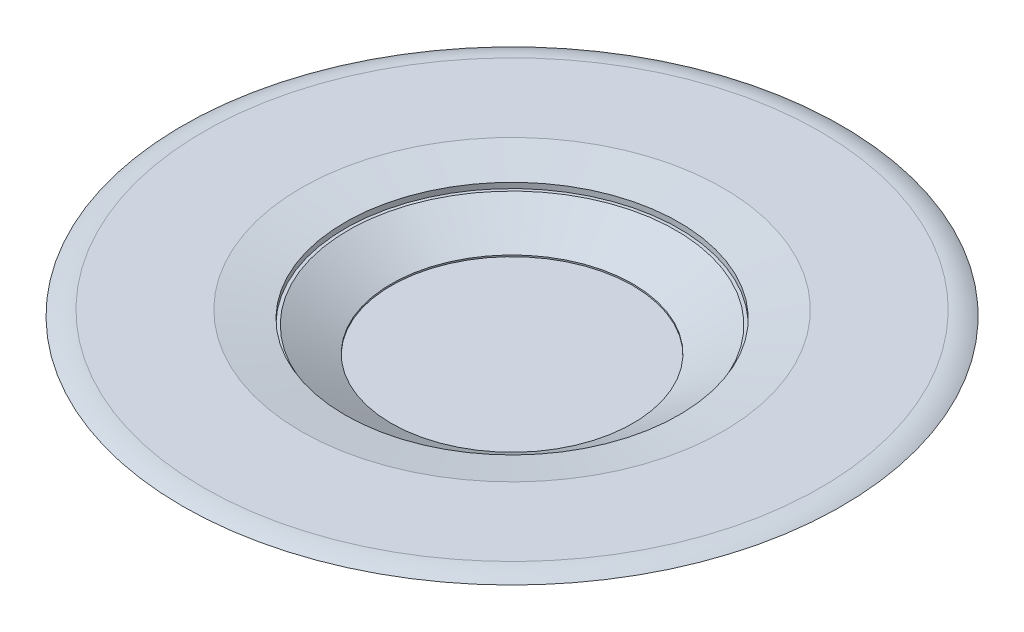
ISO-10303-21;
HEADER;
FILE_DESCRIPTION(('STEP AP214'),'2;1');
FILE_NAME('part.step','',(''),(''),'','','');
FILE_SCHEMA(('AUTOMOTIVE_DESIGN { 1 0 10303 214 1 1 1 1 }'));
ENDSEC;
DATA;
#1=APPLICATION_CONTEXT('core data for automotive mechanical design processes');
#2=APPLICATION_PROTOCOL_DEFINITION('international standard','automotive_design',2000,#1);
#3=PRODUCT_CONTEXT('',#1,'mechanical');
#4=PRODUCT('Part','Part','',(#3));
#5=PRODUCT_RELATED_PRODUCT_CATEGORY('part','',(#4));
#6=PRODUCT_DEFINITION_FORMATION('','',#4);
#7=PRODUCT_DEFINITION_CONTEXT('part definition',#1,'design');
#8=PRODUCT_DEFINITION('design','',#6,#7);
#9=PRODUCT_DEFINITION_SHAPE('','',#8);
#10=(LENGTH_UNIT() NAMED_UNIT(*) SI_UNIT(.MILLI.,.METRE.));
#11=(NAMED_UNIT(*) PLANE_ANGLE_UNIT() SI_UNIT($,.RADIAN.));
#12=(NAMED_UNIT(*) SI_UNIT($,.STERADIAN.) SOLID_ANGLE_UNIT());
#13=UNCERTAINTY_MEASURE_WITH_UNIT(LENGTH_MEASURE(1.E-05),#10,'distance_accuracy_value','');
#14=(GEOMETRIC_REPRESENTATION_CONTEXT(3) GLOBAL_UNCERTAINTY_ASSIGNED_CONTEXT((#13)) GLOBAL_UNIT_ASSIGNED_CONTEXT((#10,
#11,#12)) REPRESENTATION_CONTEXT('',''));
#15=CARTESIAN_POINT('',(0.,0.,0.));
#16=DIRECTION('',(0.,0.,1.));
#17=DIRECTION('',(1.,0.,0.));
#18=AXIS2_PLACEMENT_3D('',#15,#16,#17);
#19=CARTESIAN_POINT('',(0.,6.33974596215545,0.));
#20=DIRECTION('',(0.,1.,0.));
#21=DIRECTION('',(0.,0.,1.));
#22=AXIS2_PLACEMENT_3D('',#19,#20,#21);
#23=CONICAL_SURFACE('',#22,27.5,1.04719755119659);
#24=CARTESIAN_POINT('',(0.,6.33974596215545,0.));
#25=DIRECTION('',(0.,1.,0.));
#26=DIRECTION('',(0.,0.,1.));
#27=AXIS2_PLACEMENT_3D('',#24,#25,#26);
#28=CIRCLE('',#27,27.5);
#29=CARTESIAN_POINT('',(0.,6.33974596215545,27.5));
#30=VERTEX_POINT('',#29);
#31=EDGE_CURVE('E87',#30,#30,#28,.T.);
#32=ORIENTED_EDGE('',*,*,#31,.F.);
#33=EDGE_LOOP('',(#32));
#34=FACE_BOUND('',#33,.T.);
#35=CARTESIAN_POINT('',(0.,12.,0.));
#36=DIRECTION('',(0.,1.,0.));
#37=DIRECTION('',(0.,0.,1.));
#38=AXIS2_PLACEMENT_3D('',#35,#36,#37);
#39=CIRCLE('',#38,37.3038475772935);
#40=CARTESIAN_POINT('',(0.,12.,37.3038475772935));
#41=VERTEX_POINT('',#40);
#42=EDGE_CURVE('E93',#41,#41,#39,.T.);
#43=ORIENTED_EDGE('',*,*,#42,.T.);
#44=EDGE_LOOP('',(#43));
#45=FACE_BOUND('',#44,.T.);
#46=ADVANCED_FACE('F43',(#34,#45),#23,.F.);
#47=CARTESIAN_POINT('',(0.,6.00000000000001,0.));
#48=DIRECTION('',(0.,1.,0.));
#49=DIRECTION('',(0.,0.,1.));
#50=AXIS2_PLACEMENT_3D('',#47,#48,#49);
#51=CYLINDRICAL_SURFACE('',#50,27.5);
#52=ORIENTED_EDGE('',*,*,#31,.T.);
#53=EDGE_LOOP('',(#52));
#54=FACE_BOUND('',#53,.T.);
#55=CARTESIAN_POINT('',(0.,6.00000000000001,0.));
#56=DIRECTION('',(0.,1.,0.));
#57=DIRECTION('',(0.,0.,1.));
#58=AXIS2_PLACEMENT_3D('',#55,#56,#57);
#59=CIRCLE('',#58,27.5);
#60=CARTESIAN_POINT('',(0.,6.00000000000001,27.5));
#61=VERTEX_POINT('',#60);
#62=EDGE_CURVE('E92',#61,#61,#59,.T.);
#63=ORIENTED_EDGE('',*,*,#62,.F.);
#64=EDGE_LOOP('',(#63));
#65=FACE_BOUND('',#64,.T.);
#66=ADVANCED_FACE('F127',(#54,#65),#51,.F.);
#67=CARTESIAN_POINT('',(0.,6.00000000000001,0.));
#68=DIRECTION('',(0.,1.,0.));
#69=DIRECTION('',(0.,0.,1.));
#70=AXIS2_PLACEMENT_3D('',#67,#68,#69);
#71=PLANE('',#70);
#72=ORIENTED_EDGE('',*,*,#62,.T.);
#73=EDGE_LOOP('',(#72));
#74=FACE_BOUND('',#73,.T.);
#75=ADVANCED_FACE('F116',(#74),#71,.T.);
#76=CARTESIAN_POINT('',(0.,12.,0.));
#77=DIRECTION('',(0.,1.,0.));
#78=DIRECTION('',(0.,0.,1.));
#79=AXIS2_PLACEMENT_3D('',#76,#77,#78);
#80=CYLINDRICAL_SURFACE('',#79,38.);
#81=CARTESIAN_POINT('',(0.,13.2367301929153,0.));
#82=DIRECTION('',(0.,1.,0.));
#83=DIRECTION('',(0.,0.,1.));
#84=AXIS2_PLACEMENT_3D('',#81,#82,#83);
#85=CIRCLE('',#84,38.);
#86=CARTESIAN_POINT('',(0.,13.2367301929153,38.));
#87=VERTEX_POINT('',#86);
#88=EDGE_CURVE('E83',#87,#87,#85,.T.);
#89=ORIENTED_EDGE('',*,*,#88,.T.);
#90=EDGE_LOOP('',(#89));
#91=FACE_BOUND('',#90,.T.);
#92=CARTESIAN_POINT('',(0.,12.,0.));
#93=DIRECTION('',(0.,1.,0.));
#94=DIRECTION('',(0.,0.,1.));
#95=AXIS2_PLACEMENT_3D('',#92,#93,#94);
#96=CIRCLE('',#95,38.);
#97=CARTESIAN_POINT('',(0.,12.,38.));
#98=VERTEX_POINT('',#97);
#99=EDGE_CURVE('E107',#98,#98,#96,.T.);
#100=ORIENTED_EDGE('',*,*,#99,.F.);
#101=EDGE_LOOP('',(#100));
#102=FACE_BOUND('',#101,.T.);
#103=ADVANCED_FACE('F114',(#91,#102),#80,.F.);
#104=CARTESIAN_POINT('',(0.,12.,0.));
#105=DIRECTION('',(0.,1.,0.));
#106=DIRECTION('',(0.,0.,1.));
#107=AXIS2_PLACEMENT_3D('',#104,#105,#106);
#108=PLANE('',#107);
#109=ORIENTED_EDGE('',*,*,#42,.F.);
#110=EDGE_LOOP('',(#109));
#111=FACE_BOUND('',#110,.T.);
#112=ORIENTED_EDGE('',*,*,#99,.T.);
#113=EDGE_LOOP('',(#112));
#114=FACE_BOUND('',#113,.T.);
#115=ADVANCED_FACE('F112',(#111,#114),#108,.T.);
#116=CARTESIAN_POINT('',(0.,12.,0.));
#117=DIRECTION('',(0.,1.,0.));
#118=DIRECTION('',(0.,0.,1.));
#119=AXIS2_PLACEMENT_3D('',#116,#117,#118);
#120=PLANE('',#119);
#121=CARTESIAN_POINT('',(0.,12.,0.));
#122=DIRECTION('',(0.,1.,0.));
#123=DIRECTION('',(0.,0.,1.));
#124=AXIS2_PLACEMENT_3D('',#121,#122,#123);
#125=CIRCLE('',#124,64.9999999999998);
#126=CARTESIAN_POINT('',(0.,12.,64.9999999999998));
#127=VERTEX_POINT('',#126);
#128=EDGE_CURVE('E71',#127,#127,#125,.F.);
#129=ORIENTED_EDGE('',*,*,#128,.T.);
#130=EDGE_LOOP('',(#129));
#131=FACE_BOUND('',#130,.T.);
#132=CARTESIAN_POINT('',(0.,12.,0.));
#133=DIRECTION('',(0.,1.,0.));
#134=DIRECTION('',(0.,0.,1.));
#135=AXIS2_PLACEMENT_3D('',#132,#133,#134);
#136=CIRCLE('',#135,38.4938627006737);
#137=CARTESIAN_POINT('',(0.,12.,38.4938627006737));
#138=VERTEX_POINT('',#137);
#139=EDGE_CURVE('E88',#138,#138,#136,.F.);
#140=ORIENTED_EDGE('',*,*,#139,.F.);
#141=EDGE_LOOP('',(#140));
#142=FACE_BOUND('',#141,.T.);
#143=ADVANCED_FACE('F123',(#131,#142),#120,.F.);
#144=CARTESIAN_POINT('',(0.,15.,0.));
#145=DIRECTION('',(0.,1.,0.));
#146=DIRECTION('',(0.,0.,1.));
#147=AXIS2_PLACEMENT_3D('',#144,#145,#146);
#148=PLANE('',#147);
#149=CARTESIAN_POINT('',(0.,15.,0.));
#150=DIRECTION('',(0.,1.,0.));
#151=DIRECTION('',(0.,0.,1.));
#152=AXIS2_PLACEMENT_3D('',#149,#150,#151);
#153=CIRCLE('',#152,70.1828325451321);
#154=CARTESIAN_POINT('',(0.,15.,70.1828325451321));
#155=VERTEX_POINT('',#154);
#156=EDGE_CURVE('E67',#155,#155,#153,.T.);
#157=ORIENTED_EDGE('',*,*,#156,.T.);
#158=EDGE_LOOP('',(#157));
#159=FACE_BOUND('',#158,.T.);
#160=CARTESIAN_POINT('',(0.,15.,0.));
#161=DIRECTION('',(0.,1.,0.));
#162=DIRECTION('',(0.,0.,1.));
#163=AXIS2_PLACEMENT_3D('',#160,#161,#162);
#164=CIRCLE('',#163,48.0000000000002);
#165=CARTESIAN_POINT('',(0.,15.,48.0000000000002));
#166=VERTEX_POINT('',#165);
#167=EDGE_CURVE('E79',#166,#166,#164,.F.);
#168=ORIENTED_EDGE('',*,*,#167,.T.);
#169=EDGE_LOOP('',(#168));
#170=FACE_BOUND('',#169,.T.);
#171=ADVANCED_FACE('F198',(#159,#170),#148,.T.);
#172=CARTESIAN_POINT('',(0.,13.6602540378444,0.));
#173=DIRECTION('',(0.,1.,0.));
#174=DIRECTION('',(0.,0.,1.));
#175=AXIS2_PLACEMENT_3D('',#172,#173,#174);
#176=CONICAL_SURFACE('',#175,41.3695070476917,1.0471975511966);
#177=CARTESIAN_POINT('',(0.,5.,0.));
#178=DIRECTION('',(0.,1.,0.));
#179=DIRECTION('',(0.,0.,1.));
#180=AXIS2_PLACEMENT_3D('',#177,#178,#179);
#181=CIRCLE('',#180,26.3695070476915);
#182=CARTESIAN_POINT('',(0.,5.,26.3695070476915));
#183=VERTEX_POINT('',#182);
#184=EDGE_CURVE('E97',#183,#183,#181,.F.);
#185=ORIENTED_EDGE('',*,*,#184,.F.);
#186=EDGE_LOOP('',(#185));
#187=FACE_BOUND('',#186,.T.);
#188=ORIENTED_EDGE('',*,*,#139,.T.);
#189=EDGE_LOOP('',(#188));
#190=FACE_BOUND('',#189,.T.);
#191=ADVANCED_FACE('F149',(#187,#190),#176,.T.);
#192=CARTESIAN_POINT('',(0.,13.2367301929153,0.));
#193=DIRECTION('',(0.,1.,0.));
#194=DIRECTION('',(0.,0.,1.));
#195=AXIS2_PLACEMENT_3D('',#192,#193,#194);
#196=CONICAL_SURFACE('',#195,38.,1.39626340159547);
#197=ORIENTED_EDGE('',*,*,#167,.F.);
#198=EDGE_LOOP('',(#197));
#199=FACE_BOUND('',#198,.T.);
#200=ORIENTED_EDGE('',*,*,#88,.F.);
#201=EDGE_LOOP('',(#200));
#202=FACE_BOUND('',#201,.T.);
#203=ADVANCED_FACE('F150',(#199,#202),#196,.F.);
#204=CARTESIAN_POINT('',(0.,13.7632698070847,0.));
#205=DIRECTION('',(0.,1.,0.));
#206=DIRECTION('',(0.,0.,1.));
#207=AXIS2_PLACEMENT_3D('',#204,#205,#206);
#208=CONICAL_SURFACE('',#207,75.,1.39626340159547);
#209=ORIENTED_EDGE('',*,*,#128,.F.);
#210=EDGE_LOOP('',(#209));
#211=FACE_BOUND('',#210,.T.);
#212=CARTESIAN_POINT('',(0.,13.7632698070847,0.));
#213=DIRECTION('',(0.,1.,0.));
#214=DIRECTION('',(0.,0.,1.));
#215=AXIS2_PLACEMENT_3D('',#212,#213,#214);
#216=CIRCLE('',#215,75.);
#217=CARTESIAN_POINT('',(0.,13.7632698070847,75.));
#218=VERTEX_POINT('',#217);
#219=EDGE_CURVE('E75',#218,#218,#216,.T.);
#220=ORIENTED_EDGE('',*,*,#219,.F.);
#221=EDGE_LOOP('',(#220));
#222=FACE_BOUND('',#221,.T.);
#223=ADVANCED_FACE('F156',(#211,#222),#208,.T.);
#224=CARTESIAN_POINT('',(0.,5.,0.));
#225=DIRECTION('',(0.,-1.,0.));
#226=DIRECTION('',(0.,0.,-1.));
#227=AXIS2_PLACEMENT_3D('',#224,#225,#226);
#228=TOROIDAL_SURFACE('',#227,70.1828325451321,10.);
#229=ORIENTED_EDGE('',*,*,#219,.T.);
#230=EDGE_LOOP('',(#229));
#231=FACE_BOUND('',#230,.T.);
#232=ORIENTED_EDGE('',*,*,#156,.F.);
#233=EDGE_LOOP('',(#232));
#234=FACE_BOUND('',#233,.T.);
#235=ADVANCED_FACE('F163',(#231,#234),#228,.T.);
#236=CARTESIAN_POINT('',(0.,5.,0.));
#237=DIRECTION('',(0.,-1.,0.));
#238=DIRECTION('',(0.,0.,-1.));
#239=AXIS2_PLACEMENT_3D('',#236,#237,#238);
#240=CYLINDRICAL_SURFACE('',#239,37.3038475772935);
#241=CARTESIAN_POINT('',(0.,3.,0.));
#242=DIRECTION('',(0.,1.,0.));
#243=DIRECTION('',(0.,0.,1.));
#244=AXIS2_PLACEMENT_3D('',#241,#242,#243);
#245=CIRCLE('',#244,37.3038475772935);
#246=CARTESIAN_POINT('',(0.,3.,37.3038475772935));
#247=VERTEX_POINT('',#246);
#248=EDGE_CURVE('E10',#247,#247,#245,.F.);
#249=ORIENTED_EDGE('',*,*,#248,.T.);
#250=EDGE_LOOP('',(#249));
#251=FACE_BOUND('',#250,.T.);
#252=CARTESIAN_POINT('',(0.,1.76326980708465,0.));
#253=DIRECTION('',(0.,1.,0.));
#254=DIRECTION('',(0.,0.,1.));
#255=AXIS2_PLACEMENT_3D('',#252,#253,#254);
#256=CIRCLE('',#255,37.3038475772935);
#257=CARTESIAN_POINT('',(0.,1.76326980708465,37.3038475772935));
#258=VERTEX_POINT('',#257);
#259=EDGE_CURVE('E61',#258,#258,#256,.T.);
#260=ORIENTED_EDGE('',*,*,#259,.T.);
#261=EDGE_LOOP('',(#260));
#262=FACE_BOUND('',#261,.T.);
#263=ADVANCED_FACE('F166',(#251,#262),#240,.T.);
#264=CARTESIAN_POINT('',(0.,5.,0.));
#265=DIRECTION('',(0.,1.,0.));
#266=DIRECTION('',(0.,0.,1.));
#267=AXIS2_PLACEMENT_3D('',#264,#265,#266);
#268=PLANE('',#267);
#269=CARTESIAN_POINT('',(0.,5.,0.));
#270=DIRECTION('',(0.,1.,0.));
#271=DIRECTION('',(0.,0.,1.));
#272=AXIS2_PLACEMENT_3D('',#269,#270,#271);
#273=CIRCLE('',#272,35.3038475772935);
#274=CARTESIAN_POINT('',(0.,5.,35.3038475772935));
#275=VERTEX_POINT('',#274);
#276=EDGE_CURVE('E51',#275,#275,#273,.T.);
#277=ORIENTED_EDGE('',*,*,#276,.T.);
#278=EDGE_LOOP('',(#277));
#279=FACE_BOUND('',#278,.T.);
#280=ORIENTED_EDGE('',*,*,#184,.T.);
#281=EDGE_LOOP('',(#280));
#282=FACE_BOUND('',#281,.T.);
#283=ADVANCED_FACE('F179',(#279,#282),#268,.T.);
#284=CARTESIAN_POINT('',(0.,0.,0.));
#285=DIRECTION('',(0.,1.,0.));
#286=DIRECTION('',(0.,0.,1.));
#287=AXIS2_PLACEMENT_3D('',#284,#285,#286);
#288=PLANE('',#287);
#289=CARTESIAN_POINT('',(0.,0.,0.));
#290=DIRECTION('',(0.,1.,0.));
#291=DIRECTION('',(0.,0.,1.));
#292=AXIS2_PLACEMENT_3D('',#289,#290,#291);
#293=CIRCLE('',#292,27.3038475772933);
#294=CARTESIAN_POINT('',(0.,0.,27.3038475772933));
#295=VERTEX_POINT('',#294);
#296=EDGE_CURVE('E56',#295,#295,#293,.F.);
#297=ORIENTED_EDGE('',*,*,#296,.T.);
#298=EDGE_LOOP('',(#297));
#299=FACE_BOUND('',#298,.T.);
#300=ADVANCED_FACE('F172',(#299),#288,.F.);
#301=CARTESIAN_POINT('',(0.,1.76326980708465,0.));
#302=DIRECTION('',(0.,1.,0.));
#303=DIRECTION('',(0.,0.,1.));
#304=AXIS2_PLACEMENT_3D('',#301,#302,#303);
#305=CONICAL_SURFACE('',#304,37.3038475772935,1.39626340159547);
#306=ORIENTED_EDGE('',*,*,#296,.F.);
#307=EDGE_LOOP('',(#306));
#308=FACE_BOUND('',#307,.T.);
#309=ORIENTED_EDGE('',*,*,#259,.F.);
#310=EDGE_LOOP('',(#309));
#311=FACE_BOUND('',#310,.T.);
#312=ADVANCED_FACE('F168',(#308,#311),#305,.T.);
#313=CARTESIAN_POINT('',(0.,3.,0.));
#314=DIRECTION('',(0.,1.,0.));
#315=DIRECTION('',(0.,0.,1.));
#316=AXIS2_PLACEMENT_3D('',#313,#314,#315);
#317=TOROIDAL_SURFACE('',#316,35.3038475772935,2.);
#318=ORIENTED_EDGE('',*,*,#248,.F.);
#319=EDGE_LOOP('',(#318));
#320=FACE_BOUND('',#319,.T.);
#321=ORIENTED_EDGE('',*,*,#276,.F.);
#322=EDGE_LOOP('',(#321));
#323=FACE_BOUND('',#322,.T.);
#324=ADVANCED_FACE('F45',(#320,#323),#317,.T.);
#325=CLOSED_SHELL('',(#46,#66,#75,#103,#115,#143,#171,#191,#203,#223,#235,#263,#283,#300,#312,#324));
#326=MANIFOLD_SOLID_BREP('B2',#325);
#327=ADVANCED_BREP_SHAPE_REPRESENTATION('',(#18,#326),#14);
#328=SHAPE_DEFINITION_REPRESENTATION(#9,#327);
ENDSEC;
END-ISO-10303-21;
